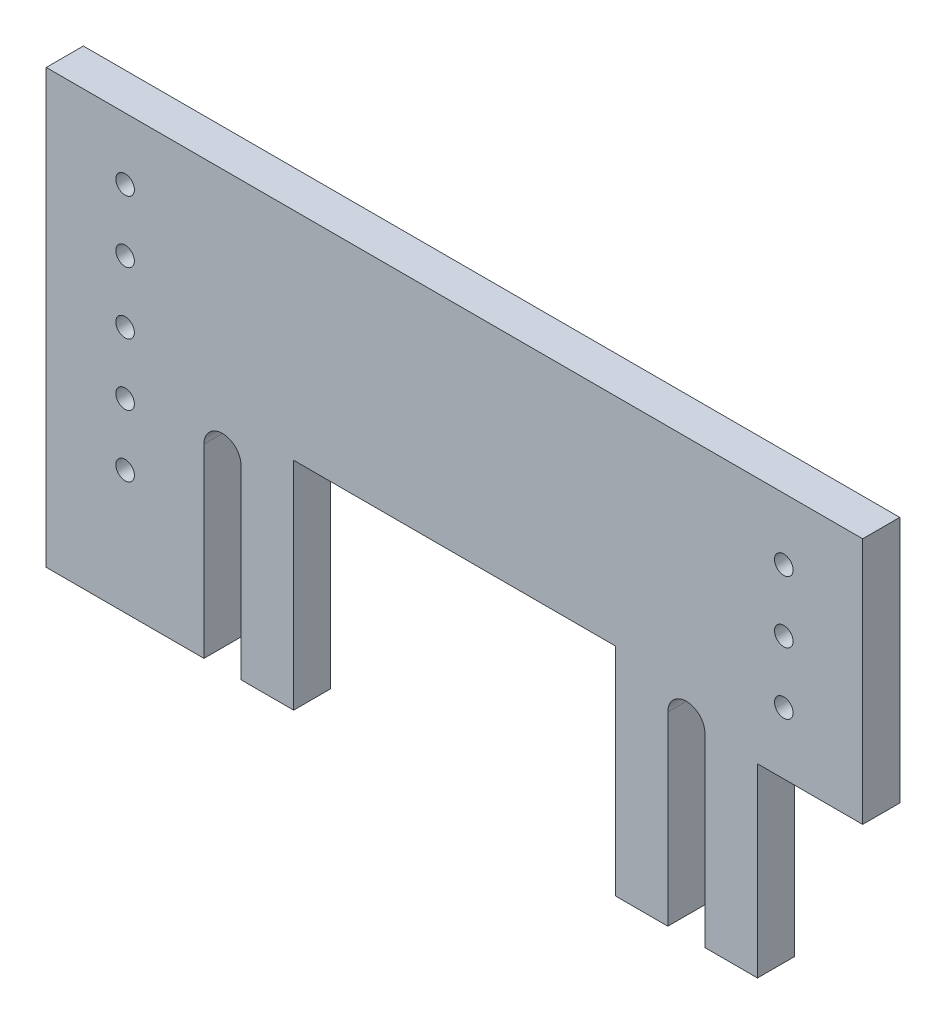
ISO-10303-21;
HEADER;
FILE_DESCRIPTION(('STEP AP214'),'2;1');
FILE_NAME('part.step','',(''),(''),'','','');
FILE_SCHEMA(('AUTOMOTIVE_DESIGN { 1 0 10303 214 1 1 1 1 }'));
ENDSEC;
DATA;
#1=APPLICATION_CONTEXT('core data for automotive mechanical design processes');
#2=APPLICATION_PROTOCOL_DEFINITION('international standard','automotive_design',2000,#1);
#3=PRODUCT_CONTEXT('',#1,'mechanical');
#4=PRODUCT('Part','Part','',(#3));
#5=PRODUCT_RELATED_PRODUCT_CATEGORY('part','',(#4));
#6=PRODUCT_DEFINITION_FORMATION('','',#4);
#7=PRODUCT_DEFINITION_CONTEXT('part definition',#1,'design');
#8=PRODUCT_DEFINITION('design','',#6,#7);
#9=PRODUCT_DEFINITION_SHAPE('','',#8);
#10=(LENGTH_UNIT() NAMED_UNIT(*) SI_UNIT(.MILLI.,.METRE.));
#11=(NAMED_UNIT(*) PLANE_ANGLE_UNIT() SI_UNIT($,.RADIAN.));
#12=(NAMED_UNIT(*) SI_UNIT($,.STERADIAN.) SOLID_ANGLE_UNIT());
#13=UNCERTAINTY_MEASURE_WITH_UNIT(LENGTH_MEASURE(1.E-05),#10,'distance_accuracy_value','');
#14=(GEOMETRIC_REPRESENTATION_CONTEXT(3) GLOBAL_UNCERTAINTY_ASSIGNED_CONTEXT((#13)) GLOBAL_UNIT_ASSIGNED_CONTEXT((#10,
#11,#12)) REPRESENTATION_CONTEXT('',''));
#15=CARTESIAN_POINT('',(0.,0.,0.));
#16=DIRECTION('',(0.,0.,1.));
#17=DIRECTION('',(1.,0.,0.));
#18=AXIS2_PLACEMENT_3D('',#15,#16,#17);
#19=CARTESIAN_POINT('',(37.5,-5.,6.));
#20=DIRECTION('',(0.,0.,1.));
#21=DIRECTION('',(1.,0.,0.));
#22=AXIS2_PLACEMENT_3D('',#19,#20,#21);
#23=PLANE('',#22);
#24=CARTESIAN_POINT('',(53.25,25.,6.));
#25=DIRECTION('',(0.,0.,1.));
#26=DIRECTION('',(-1.,0.,0.));
#27=AXIS2_PLACEMENT_3D('',#24,#25,#26);
#28=CIRCLE('',#27,1.50000000000002);
#29=CARTESIAN_POINT('',(51.75,25.,6.));
#30=VERTEX_POINT('',#29);
#31=EDGE_CURVE('E385',#30,#30,#28,.T.);
#32=ORIENTED_EDGE('',*,*,#31,.F.);
#33=EDGE_LOOP('',(#32));
#34=FACE_BOUND('',#33,.T.);
#35=CARTESIAN_POINT('',(53.25,5.,6.));
#36=DIRECTION('',(0.,0.,1.));
#37=DIRECTION('',(-1.,0.,0.));
#38=AXIS2_PLACEMENT_3D('',#35,#36,#37);
#39=CIRCLE('',#38,1.50000000000002);
#40=CARTESIAN_POINT('',(51.75,5.,6.));
#41=VERTEX_POINT('',#40);
#42=EDGE_CURVE('E397',#41,#41,#39,.T.);
#43=ORIENTED_EDGE('',*,*,#42,.F.);
#44=EDGE_LOOP('',(#43));
#45=FACE_BOUND('',#44,.T.);
#46=CARTESIAN_POINT('',(-53.25,25.,6.));
#47=DIRECTION('',(0.,0.,1.));
#48=DIRECTION('',(1.,0.,0.));
#49=AXIS2_PLACEMENT_3D('',#46,#47,#48);
#50=CIRCLE('',#49,1.5);
#51=CARTESIAN_POINT('',(-51.75,25.,6.));
#52=VERTEX_POINT('',#51);
#53=EDGE_CURVE('E409',#52,#52,#50,.T.);
#54=ORIENTED_EDGE('',*,*,#53,.F.);
#55=EDGE_LOOP('',(#54));
#56=FACE_BOUND('',#55,.T.);
#57=CARTESIAN_POINT('',(-53.25,15.,6.));
#58=DIRECTION('',(0.,0.,1.));
#59=DIRECTION('',(1.,0.,0.));
#60=AXIS2_PLACEMENT_3D('',#57,#58,#59);
#61=CIRCLE('',#60,1.5);
#62=CARTESIAN_POINT('',(-51.75,15.,6.));
#63=VERTEX_POINT('',#62);
#64=EDGE_CURVE('E194',#63,#63,#61,.T.);
#65=ORIENTED_EDGE('',*,*,#64,.F.);
#66=EDGE_LOOP('',(#65));
#67=FACE_BOUND('',#66,.T.);
#68=DIRECTION('',(0.,-1.,0.));
#69=VECTOR('',#68,1.);
#70=CARTESIAN_POINT('',(-66.,-35.,6.));
#71=LINE('',#70,#69);
#72=CARTESIAN_POINT('',(-66.,35.,6.));
#73=VERTEX_POINT('',#72);
#74=CARTESIAN_POINT('',(-66.,-35.,6.));
#75=VERTEX_POINT('',#74);
#76=EDGE_CURVE('E225',#73,#75,#71,.T.);
#77=ORIENTED_EDGE('',*,*,#76,.T.);
#78=DIRECTION('',(1.,0.,0.));
#79=VECTOR('',#78,1.);
#80=CARTESIAN_POINT('',(-66.,-35.,6.));
#81=LINE('',#80,#79);
#82=CARTESIAN_POINT('',(-40.5,-35.,6.));
#83=VERTEX_POINT('',#82);
#84=EDGE_CURVE('E123',#75,#83,#81,.T.);
#85=ORIENTED_EDGE('',*,*,#84,.T.);
#86=DIRECTION('',(0.,1.,0.));
#87=VECTOR('',#86,1.);
#88=CARTESIAN_POINT('',(-40.5,-5.,6.));
#89=LINE('',#88,#87);
#90=CARTESIAN_POINT('',(-40.5,-5.,6.));
#91=VERTEX_POINT('',#90);
#92=EDGE_CURVE('E270',#83,#91,#89,.T.);
#93=ORIENTED_EDGE('',*,*,#92,.T.);
#94=CARTESIAN_POINT('',(-37.5,-5.,6.));
#95=DIRECTION('',(0.,0.,-1.));
#96=DIRECTION('',(1.,0.,0.));
#97=AXIS2_PLACEMENT_3D('',#94,#95,#96);
#98=CIRCLE('',#97,3.);
#99=CARTESIAN_POINT('',(-34.5,-5.,6.));
#100=VERTEX_POINT('',#99);
#101=EDGE_CURVE('E289',#91,#100,#98,.T.);
#102=ORIENTED_EDGE('',*,*,#101,.T.);
#103=DIRECTION('',(0.,-1.,0.));
#104=VECTOR('',#103,1.);
#105=CARTESIAN_POINT('',(-34.5,-5.,6.));
#106=LINE('',#105,#104);
#107=CARTESIAN_POINT('',(-34.5,-35.,6.));
#108=VERTEX_POINT('',#107);
#109=EDGE_CURVE('E286',#100,#108,#106,.T.);
#110=ORIENTED_EDGE('',*,*,#109,.T.);
#111=DIRECTION('',(1.,0.,0.));
#112=VECTOR('',#111,1.);
#113=CARTESIAN_POINT('',(-26.,-35.,6.));
#114=LINE('',#113,#112);
#115=CARTESIAN_POINT('',(-26.,-35.,6.));
#116=VERTEX_POINT('',#115);
#117=EDGE_CURVE('E288',#108,#116,#114,.T.);
#118=ORIENTED_EDGE('',*,*,#117,.T.);
#119=DIRECTION('',(0.,1.,0.));
#120=VECTOR('',#119,1.);
#121=CARTESIAN_POINT('',(-26.,-35.,6.));
#122=LINE('',#121,#120);
#123=CARTESIAN_POINT('',(-26.,0.,6.));
#124=VERTEX_POINT('',#123);
#125=EDGE_CURVE('E291',#116,#124,#122,.T.);
#126=ORIENTED_EDGE('',*,*,#125,.T.);
#127=DIRECTION('',(1.,0.,0.));
#128=VECTOR('',#127,1.);
#129=CARTESIAN_POINT('',(26.,0.,6.));
#130=LINE('',#129,#128);
#131=CARTESIAN_POINT('',(26.,0.,6.));
#132=VERTEX_POINT('',#131);
#133=EDGE_CURVE('E297',#124,#132,#130,.T.);
#134=ORIENTED_EDGE('',*,*,#133,.T.);
#135=DIRECTION('',(0.,-1.,0.));
#136=VECTOR('',#135,1.);
#137=CARTESIAN_POINT('',(26.,-35.,6.));
#138=LINE('',#137,#136);
#139=CARTESIAN_POINT('',(26.,-35.,6.));
#140=VERTEX_POINT('',#139);
#141=EDGE_CURVE('E299',#132,#140,#138,.T.);
#142=ORIENTED_EDGE('',*,*,#141,.T.);
#143=DIRECTION('',(1.,0.,0.));
#144=VECTOR('',#143,1.);
#145=CARTESIAN_POINT('',(34.5,-35.,6.));
#146=LINE('',#145,#144);
#147=CARTESIAN_POINT('',(34.5,-35.,6.));
#148=VERTEX_POINT('',#147);
#149=EDGE_CURVE('E301',#140,#148,#146,.T.);
#150=ORIENTED_EDGE('',*,*,#149,.T.);
#151=DIRECTION('',(0.,1.,0.));
#152=VECTOR('',#151,1.);
#153=CARTESIAN_POINT('',(34.5,-5.,6.));
#154=LINE('',#153,#152);
#155=CARTESIAN_POINT('',(34.5,-5.,6.));
#156=VERTEX_POINT('',#155);
#157=EDGE_CURVE('E303',#148,#156,#154,.T.);
#158=ORIENTED_EDGE('',*,*,#157,.T.);
#159=CARTESIAN_POINT('',(37.5,-5.,6.));
#160=DIRECTION('',(0.,0.,-1.));
#161=DIRECTION('',(1.,0.,0.));
#162=AXIS2_PLACEMENT_3D('',#159,#160,#161);
#163=CIRCLE('',#162,3.);
#164=CARTESIAN_POINT('',(40.5,-5.,6.));
#165=VERTEX_POINT('',#164);
#166=EDGE_CURVE('E305',#156,#165,#163,.T.);
#167=ORIENTED_EDGE('',*,*,#166,.T.);
#168=DIRECTION('',(0.,-1.,0.));
#169=VECTOR('',#168,1.);
#170=CARTESIAN_POINT('',(40.5,-5.,6.));
#171=LINE('',#170,#169);
#172=CARTESIAN_POINT('',(40.5,-35.,6.));
#173=VERTEX_POINT('',#172);
#174=EDGE_CURVE('E307',#165,#173,#171,.T.);
#175=ORIENTED_EDGE('',*,*,#174,.T.);
#176=DIRECTION('',(1.,0.,0.));
#177=VECTOR('',#176,1.);
#178=CARTESIAN_POINT('',(40.5,-35.,6.));
#179=LINE('',#178,#177);
#180=CARTESIAN_POINT('',(49.,-35.,6.));
#181=VERTEX_POINT('',#180);
#182=EDGE_CURVE('E309',#173,#181,#179,.T.);
#183=ORIENTED_EDGE('',*,*,#182,.T.);
#184=DIRECTION('',(0.,1.,0.));
#185=VECTOR('',#184,1.);
#186=CARTESIAN_POINT('',(49.,-35.,6.));
#187=LINE('',#186,#185);
#188=CARTESIAN_POINT('',(49.,-5.,6.));
#189=VERTEX_POINT('',#188);
#190=EDGE_CURVE('E172',#181,#189,#187,.T.);
#191=ORIENTED_EDGE('',*,*,#190,.T.);
#192=DIRECTION('',(1.,0.,0.));
#193=VECTOR('',#192,1.);
#194=CARTESIAN_POINT('',(49.,-5.,6.));
#195=LINE('',#194,#193);
#196=CARTESIAN_POINT('',(66.,-5.,6.));
#197=VERTEX_POINT('',#196);
#198=EDGE_CURVE('E166',#189,#197,#195,.T.);
#199=ORIENTED_EDGE('',*,*,#198,.T.);
#200=DIRECTION('',(0.,1.,0.));
#201=VECTOR('',#200,1.);
#202=CARTESIAN_POINT('',(66.,-5.,6.));
#203=LINE('',#202,#201);
#204=CARTESIAN_POINT('',(66.,35.,6.));
#205=VERTEX_POINT('',#204);
#206=EDGE_CURVE('E170',#197,#205,#203,.T.);
#207=ORIENTED_EDGE('',*,*,#206,.T.);
#208=DIRECTION('',(-1.,0.,0.));
#209=VECTOR('',#208,1.);
#210=CARTESIAN_POINT('',(66.,35.,6.));
#211=LINE('',#210,#209);
#212=EDGE_CURVE('E50',#205,#73,#211,.T.);
#213=ORIENTED_EDGE('',*,*,#212,.T.);
#214=EDGE_LOOP('',(#77,#85,#93,#102,#110,#118,#126,#134,#142,#150,#158,#167,#175,#183,#191,#199,
#207,#213));
#215=FACE_BOUND('',#214,.T.);
#216=CARTESIAN_POINT('',(-53.25,-5.,6.));
#217=DIRECTION('',(0.,0.,1.));
#218=DIRECTION('',(1.,0.,0.));
#219=AXIS2_PLACEMENT_3D('',#216,#217,#218);
#220=CIRCLE('',#219,1.5);
#221=CARTESIAN_POINT('',(-51.75,-5.,6.));
#222=VERTEX_POINT('',#221);
#223=EDGE_CURVE('E415',#222,#222,#220,.T.);
#224=ORIENTED_EDGE('',*,*,#223,.F.);
#225=EDGE_LOOP('',(#224));
#226=FACE_BOUND('',#225,.T.);
#227=CARTESIAN_POINT('',(-53.25,-15.,6.));
#228=DIRECTION('',(0.,0.,1.));
#229=DIRECTION('',(1.,0.,0.));
#230=AXIS2_PLACEMENT_3D('',#227,#228,#229);
#231=CIRCLE('',#230,1.5);
#232=CARTESIAN_POINT('',(-51.75,-15.,6.));
#233=VERTEX_POINT('',#232);
#234=EDGE_CURVE('E403',#233,#233,#231,.T.);
#235=ORIENTED_EDGE('',*,*,#234,.F.);
#236=EDGE_LOOP('',(#235));
#237=FACE_BOUND('',#236,.T.);
#238=CARTESIAN_POINT('',(-53.25,5.,6.));
#239=DIRECTION('',(0.,0.,1.));
#240=DIRECTION('',(1.,0.,0.));
#241=AXIS2_PLACEMENT_3D('',#238,#239,#240);
#242=CIRCLE('',#241,1.5);
#243=CARTESIAN_POINT('',(-51.75,5.,6.));
#244=VERTEX_POINT('',#243);
#245=EDGE_CURVE('E391',#244,#244,#242,.T.);
#246=ORIENTED_EDGE('',*,*,#245,.F.);
#247=EDGE_LOOP('',(#246));
#248=FACE_BOUND('',#247,.T.);
#249=CARTESIAN_POINT('',(53.25,15.,6.));
#250=DIRECTION('',(0.,0.,1.));
#251=DIRECTION('',(-1.,0.,0.));
#252=AXIS2_PLACEMENT_3D('',#249,#250,#251);
#253=CIRCLE('',#252,1.49999999999999);
#254=CARTESIAN_POINT('',(51.75,15.,6.));
#255=VERTEX_POINT('',#254);
#256=EDGE_CURVE('E376',#255,#255,#253,.T.);
#257=ORIENTED_EDGE('',*,*,#256,.F.);
#258=EDGE_LOOP('',(#257));
#259=FACE_BOUND('',#258,.T.);
#260=ADVANCED_FACE('F33',(#34,#45,#56,#67,#215,#226,#237,#248,#259),#23,.T.);
#261=CARTESIAN_POINT('',(37.5,-5.,0.));
#262=DIRECTION('',(0.,0.,1.));
#263=DIRECTION('',(1.,0.,0.));
#264=AXIS2_PLACEMENT_3D('',#261,#262,#263);
#265=PLANE('',#264);
#266=DIRECTION('',(0.,-1.,0.));
#267=VECTOR('',#266,1.);
#268=CARTESIAN_POINT('',(-66.,-35.,0.));
#269=LINE('',#268,#267);
#270=CARTESIAN_POINT('',(-66.,35.,0.));
#271=VERTEX_POINT('',#270);
#272=CARTESIAN_POINT('',(-66.,-35.,0.));
#273=VERTEX_POINT('',#272);
#274=EDGE_CURVE('E190',#271,#273,#269,.T.);
#275=ORIENTED_EDGE('',*,*,#274,.F.);
#276=DIRECTION('',(-1.,0.,0.));
#277=VECTOR('',#276,1.);
#278=CARTESIAN_POINT('',(66.,35.,0.));
#279=LINE('',#278,#277);
#280=CARTESIAN_POINT('',(66.,35.,0.));
#281=VERTEX_POINT('',#280);
#282=EDGE_CURVE('E115',#281,#271,#279,.T.);
#283=ORIENTED_EDGE('',*,*,#282,.F.);
#284=DIRECTION('',(0.,1.,0.));
#285=VECTOR('',#284,1.);
#286=CARTESIAN_POINT('',(66.,-5.,0.));
#287=LINE('',#286,#285);
#288=CARTESIAN_POINT('',(66.,-5.,0.));
#289=VERTEX_POINT('',#288);
#290=EDGE_CURVE('E109',#289,#281,#287,.T.);
#291=ORIENTED_EDGE('',*,*,#290,.F.);
#292=DIRECTION('',(1.,0.,0.));
#293=VECTOR('',#292,1.);
#294=CARTESIAN_POINT('',(49.,-5.,0.));
#295=LINE('',#294,#293);
#296=CARTESIAN_POINT('',(49.,-5.,0.));
#297=VERTEX_POINT('',#296);
#298=EDGE_CURVE('E180',#297,#289,#295,.T.);
#299=ORIENTED_EDGE('',*,*,#298,.F.);
#300=DIRECTION('',(0.,1.,0.));
#301=VECTOR('',#300,1.);
#302=CARTESIAN_POINT('',(49.,-35.,0.));
#303=LINE('',#302,#301);
#304=CARTESIAN_POINT('',(49.,-35.,0.));
#305=VERTEX_POINT('',#304);
#306=EDGE_CURVE('E220',#305,#297,#303,.T.);
#307=ORIENTED_EDGE('',*,*,#306,.F.);
#308=DIRECTION('',(1.,0.,0.));
#309=VECTOR('',#308,1.);
#310=CARTESIAN_POINT('',(40.5,-35.,0.));
#311=LINE('',#310,#309);
#312=CARTESIAN_POINT('',(40.5,-35.,0.));
#313=VERTEX_POINT('',#312);
#314=EDGE_CURVE('E218',#313,#305,#311,.T.);
#315=ORIENTED_EDGE('',*,*,#314,.F.);
#316=DIRECTION('',(0.,-1.,0.));
#317=VECTOR('',#316,1.);
#318=CARTESIAN_POINT('',(40.5,-5.,0.));
#319=LINE('',#318,#317);
#320=CARTESIAN_POINT('',(40.5,-5.,0.));
#321=VERTEX_POINT('',#320);
#322=EDGE_CURVE('E216',#321,#313,#319,.T.);
#323=ORIENTED_EDGE('',*,*,#322,.F.);
#324=CARTESIAN_POINT('',(37.5,-5.,0.));
#325=DIRECTION('',(0.,0.,-1.));
#326=DIRECTION('',(1.,0.,0.));
#327=AXIS2_PLACEMENT_3D('',#324,#325,#326);
#328=CIRCLE('',#327,3.);
#329=CARTESIAN_POINT('',(34.5,-5.,0.));
#330=VERTEX_POINT('',#329);
#331=EDGE_CURVE('E214',#330,#321,#328,.T.);
#332=ORIENTED_EDGE('',*,*,#331,.F.);
#333=DIRECTION('',(0.,1.,0.));
#334=VECTOR('',#333,1.);
#335=CARTESIAN_POINT('',(34.5,-5.,0.));
#336=LINE('',#335,#334);
#337=CARTESIAN_POINT('',(34.5,-35.,0.));
#338=VERTEX_POINT('',#337);
#339=EDGE_CURVE('E212',#338,#330,#336,.T.);
#340=ORIENTED_EDGE('',*,*,#339,.F.);
#341=DIRECTION('',(1.,0.,0.));
#342=VECTOR('',#341,1.);
#343=CARTESIAN_POINT('',(34.5,-35.,0.));
#344=LINE('',#343,#342);
#345=CARTESIAN_POINT('',(26.,-35.,0.));
#346=VERTEX_POINT('',#345);
#347=EDGE_CURVE('E210',#346,#338,#344,.T.);
#348=ORIENTED_EDGE('',*,*,#347,.F.);
#349=DIRECTION('',(0.,-1.,0.));
#350=VECTOR('',#349,1.);
#351=CARTESIAN_POINT('',(26.,-35.,0.));
#352=LINE('',#351,#350);
#353=CARTESIAN_POINT('',(26.,0.,0.));
#354=VERTEX_POINT('',#353);
#355=EDGE_CURVE('E208',#354,#346,#352,.T.);
#356=ORIENTED_EDGE('',*,*,#355,.F.);
#357=DIRECTION('',(1.,0.,0.));
#358=VECTOR('',#357,1.);
#359=CARTESIAN_POINT('',(26.,0.,0.));
#360=LINE('',#359,#358);
#361=CARTESIAN_POINT('',(-26.,0.,0.));
#362=VERTEX_POINT('',#361);
#363=EDGE_CURVE('E206',#362,#354,#360,.T.);
#364=ORIENTED_EDGE('',*,*,#363,.F.);
#365=DIRECTION('',(0.,1.,0.));
#366=VECTOR('',#365,1.);
#367=CARTESIAN_POINT('',(-26.,-35.,0.));
#368=LINE('',#367,#366);
#369=CARTESIAN_POINT('',(-26.,-35.,0.));
#370=VERTEX_POINT('',#369);
#371=EDGE_CURVE('E204',#370,#362,#368,.T.);
#372=ORIENTED_EDGE('',*,*,#371,.F.);
#373=DIRECTION('',(1.,0.,0.));
#374=VECTOR('',#373,1.);
#375=CARTESIAN_POINT('',(-26.,-35.,0.));
#376=LINE('',#375,#374);
#377=CARTESIAN_POINT('',(-34.5,-35.,0.));
#378=VERTEX_POINT('',#377);
#379=EDGE_CURVE('E202',#378,#370,#376,.T.);
#380=ORIENTED_EDGE('',*,*,#379,.F.);
#381=DIRECTION('',(0.,-1.,0.));
#382=VECTOR('',#381,1.);
#383=CARTESIAN_POINT('',(-34.5,-5.,0.));
#384=LINE('',#383,#382);
#385=CARTESIAN_POINT('',(-34.5,-5.,0.));
#386=VERTEX_POINT('',#385);
#387=EDGE_CURVE('E200',#386,#378,#384,.T.);
#388=ORIENTED_EDGE('',*,*,#387,.F.);
#389=CARTESIAN_POINT('',(-37.5,-5.,0.));
#390=DIRECTION('',(0.,0.,-1.));
#391=DIRECTION('',(1.,0.,0.));
#392=AXIS2_PLACEMENT_3D('',#389,#390,#391);
#393=CIRCLE('',#392,3.);
#394=CARTESIAN_POINT('',(-40.5,-5.,0.));
#395=VERTEX_POINT('',#394);
#396=EDGE_CURVE('E198',#395,#386,#393,.T.);
#397=ORIENTED_EDGE('',*,*,#396,.F.);
#398=DIRECTION('',(0.,1.,0.));
#399=VECTOR('',#398,1.);
#400=CARTESIAN_POINT('',(-40.5,-5.,0.));
#401=LINE('',#400,#399);
#402=CARTESIAN_POINT('',(-40.5,-35.,0.));
#403=VERTEX_POINT('',#402);
#404=EDGE_CURVE('E196',#403,#395,#401,.T.);
#405=ORIENTED_EDGE('',*,*,#404,.F.);
#406=DIRECTION('',(1.,0.,0.));
#407=VECTOR('',#406,1.);
#408=CARTESIAN_POINT('',(-66.,-35.,0.));
#409=LINE('',#408,#407);
#410=EDGE_CURVE('E193',#273,#403,#409,.T.);
#411=ORIENTED_EDGE('',*,*,#410,.F.);
#412=EDGE_LOOP('',(#275,#283,#291,#299,#307,#315,#323,#332,#340,#348,#356,#364,#372,#380,#388,
#397,#405,#411));
#413=FACE_BOUND('',#412,.T.);
#414=CARTESIAN_POINT('',(-53.25,15.,0.));
#415=DIRECTION('',(0.,0.,1.));
#416=DIRECTION('',(1.,0.,0.));
#417=AXIS2_PLACEMENT_3D('',#414,#415,#416);
#418=CIRCLE('',#417,1.5);
#419=CARTESIAN_POINT('',(-51.75,15.,0.));
#420=VERTEX_POINT('',#419);
#421=EDGE_CURVE('E418',#420,#420,#418,.T.);
#422=ORIENTED_EDGE('',*,*,#421,.T.);
#423=EDGE_LOOP('',(#422));
#424=FACE_BOUND('',#423,.T.);
#425=CARTESIAN_POINT('',(-53.25,-5.,0.));
#426=DIRECTION('',(0.,0.,1.));
#427=DIRECTION('',(1.,0.,0.));
#428=AXIS2_PLACEMENT_3D('',#425,#426,#427);
#429=CIRCLE('',#428,1.5);
#430=CARTESIAN_POINT('',(-51.75,-5.,0.));
#431=VERTEX_POINT('',#430);
#432=EDGE_CURVE('E412',#431,#431,#429,.T.);
#433=ORIENTED_EDGE('',*,*,#432,.T.);
#434=EDGE_LOOP('',(#433));
#435=FACE_BOUND('',#434,.T.);
#436=CARTESIAN_POINT('',(-53.25,25.,0.));
#437=DIRECTION('',(0.,0.,1.));
#438=DIRECTION('',(1.,0.,0.));
#439=AXIS2_PLACEMENT_3D('',#436,#437,#438);
#440=CIRCLE('',#439,1.5);
#441=CARTESIAN_POINT('',(-51.75,25.,0.));
#442=VERTEX_POINT('',#441);
#443=EDGE_CURVE('E406',#442,#442,#440,.T.);
#444=ORIENTED_EDGE('',*,*,#443,.T.);
#445=EDGE_LOOP('',(#444));
#446=FACE_BOUND('',#445,.T.);
#447=CARTESIAN_POINT('',(-53.25,-15.,0.));
#448=DIRECTION('',(0.,0.,1.));
#449=DIRECTION('',(1.,0.,0.));
#450=AXIS2_PLACEMENT_3D('',#447,#448,#449);
#451=CIRCLE('',#450,1.5);
#452=CARTESIAN_POINT('',(-51.75,-15.,0.));
#453=VERTEX_POINT('',#452);
#454=EDGE_CURVE('E400',#453,#453,#451,.T.);
#455=ORIENTED_EDGE('',*,*,#454,.T.);
#456=EDGE_LOOP('',(#455));
#457=FACE_BOUND('',#456,.T.);
#458=CARTESIAN_POINT('',(53.25,5.,0.));
#459=DIRECTION('',(0.,0.,1.));
#460=DIRECTION('',(-1.,0.,0.));
#461=AXIS2_PLACEMENT_3D('',#458,#459,#460);
#462=CIRCLE('',#461,1.50000000000002);
#463=CARTESIAN_POINT('',(51.75,5.,0.));
#464=VERTEX_POINT('',#463);
#465=EDGE_CURVE('E394',#464,#464,#462,.T.);
#466=ORIENTED_EDGE('',*,*,#465,.T.);
#467=EDGE_LOOP('',(#466));
#468=FACE_BOUND('',#467,.T.);
#469=CARTESIAN_POINT('',(-53.25,5.,0.));
#470=DIRECTION('',(0.,0.,1.));
#471=DIRECTION('',(1.,0.,0.));
#472=AXIS2_PLACEMENT_3D('',#469,#470,#471);
#473=CIRCLE('',#472,1.5);
#474=CARTESIAN_POINT('',(-51.75,5.,0.));
#475=VERTEX_POINT('',#474);
#476=EDGE_CURVE('E388',#475,#475,#473,.T.);
#477=ORIENTED_EDGE('',*,*,#476,.T.);
#478=EDGE_LOOP('',(#477));
#479=FACE_BOUND('',#478,.T.);
#480=CARTESIAN_POINT('',(53.25,25.,0.));
#481=DIRECTION('',(0.,0.,1.));
#482=DIRECTION('',(-1.,0.,0.));
#483=AXIS2_PLACEMENT_3D('',#480,#481,#482);
#484=CIRCLE('',#483,1.50000000000002);
#485=CARTESIAN_POINT('',(51.75,25.,0.));
#486=VERTEX_POINT('',#485);
#487=EDGE_CURVE('E382',#486,#486,#484,.T.);
#488=ORIENTED_EDGE('',*,*,#487,.T.);
#489=EDGE_LOOP('',(#488));
#490=FACE_BOUND('',#489,.T.);
#491=CARTESIAN_POINT('',(53.25,15.,0.));
#492=DIRECTION('',(0.,0.,1.));
#493=DIRECTION('',(-1.,0.,0.));
#494=AXIS2_PLACEMENT_3D('',#491,#492,#493);
#495=CIRCLE('',#494,1.49999999999999);
#496=CARTESIAN_POINT('',(51.75,15.,0.));
#497=VERTEX_POINT('',#496);
#498=EDGE_CURVE('E379',#497,#497,#495,.T.);
#499=ORIENTED_EDGE('',*,*,#498,.T.);
#500=EDGE_LOOP('',(#499));
#501=FACE_BOUND('',#500,.T.);
#502=ADVANCED_FACE('F274',(#413,#424,#435,#446,#457,#468,#479,#490,#501),#265,.F.);
#503=CARTESIAN_POINT('',(-66.,-35.,6.));
#504=DIRECTION('',(1.,0.,0.));
#505=DIRECTION('',(0.,0.,-1.));
#506=AXIS2_PLACEMENT_3D('',#503,#504,#505);
#507=PLANE('',#506);
#508=ORIENTED_EDGE('',*,*,#274,.T.);
#509=DIRECTION('',(0.,0.,-1.));
#510=VECTOR('',#509,1.);
#511=CARTESIAN_POINT('',(-66.,-35.,6.));
#512=LINE('',#511,#510);
#513=EDGE_CURVE('E11',#75,#273,#512,.T.);
#514=ORIENTED_EDGE('',*,*,#513,.F.);
#515=ORIENTED_EDGE('',*,*,#76,.F.);
#516=DIRECTION('',(0.,0.,-1.));
#517=VECTOR('',#516,1.);
#518=CARTESIAN_POINT('',(-66.,35.,6.));
#519=LINE('',#518,#517);
#520=EDGE_CURVE('E186',#73,#271,#519,.T.);
#521=ORIENTED_EDGE('',*,*,#520,.T.);
#522=EDGE_LOOP('',(#508,#514,#515,#521));
#523=FACE_BOUND('',#522,.T.);
#524=ADVANCED_FACE('F35',(#523),#507,.F.);
#525=CARTESIAN_POINT('',(-66.,-35.,6.));
#526=DIRECTION('',(0.,1.,0.));
#527=DIRECTION('',(0.,0.,1.));
#528=AXIS2_PLACEMENT_3D('',#525,#526,#527);
#529=PLANE('',#528);
#530=ORIENTED_EDGE('',*,*,#410,.T.);
#531=DIRECTION('',(0.,0.,-1.));
#532=VECTOR('',#531,1.);
#533=CARTESIAN_POINT('',(-40.5,-35.,6.));
#534=LINE('',#533,#532);
#535=EDGE_CURVE('E42',#83,#403,#534,.T.);
#536=ORIENTED_EDGE('',*,*,#535,.F.);
#537=ORIENTED_EDGE('',*,*,#84,.F.);
#538=ORIENTED_EDGE('',*,*,#513,.T.);
#539=EDGE_LOOP('',(#530,#536,#537,#538));
#540=FACE_BOUND('',#539,.T.);
#541=ADVANCED_FACE('F624',(#540),#529,.F.);
#542=CARTESIAN_POINT('',(-40.5,-5.,6.));
#543=DIRECTION('',(-1.,0.,0.));
#544=DIRECTION('',(0.,-1.,0.));
#545=AXIS2_PLACEMENT_3D('',#542,#543,#544);
#546=PLANE('',#545);
#547=ORIENTED_EDGE('',*,*,#404,.T.);
#548=DIRECTION('',(0.,0.,-1.));
#549=VECTOR('',#548,1.);
#550=CARTESIAN_POINT('',(-40.5,-5.,6.));
#551=LINE('',#550,#549);
#552=EDGE_CURVE('E262',#91,#395,#551,.T.);
#553=ORIENTED_EDGE('',*,*,#552,.F.);
#554=ORIENTED_EDGE('',*,*,#92,.F.);
#555=ORIENTED_EDGE('',*,*,#535,.T.);
#556=EDGE_LOOP('',(#547,#553,#554,#555));
#557=FACE_BOUND('',#556,.T.);
#558=ADVANCED_FACE('F268',(#557),#546,.F.);
#559=CARTESIAN_POINT('',(-37.5,-5.,6.));
#560=DIRECTION('',(0.,0.,-1.));
#561=DIRECTION('',(-1.,0.,0.));
#562=AXIS2_PLACEMENT_3D('',#559,#560,#561);
#563=CYLINDRICAL_SURFACE('',#562,3.);
#564=ORIENTED_EDGE('',*,*,#396,.T.);
#565=DIRECTION('',(0.,0.,-1.));
#566=VECTOR('',#565,1.);
#567=CARTESIAN_POINT('',(-34.5,-5.,6.));
#568=LINE('',#567,#566);
#569=EDGE_CURVE('E259',#100,#386,#568,.T.);
#570=ORIENTED_EDGE('',*,*,#569,.F.);
#571=ORIENTED_EDGE('',*,*,#101,.F.);
#572=ORIENTED_EDGE('',*,*,#552,.T.);
#573=EDGE_LOOP('',(#564,#570,#571,#572));
#574=FACE_BOUND('',#573,.T.);
#575=ADVANCED_FACE('F280',(#574),#563,.F.);
#576=CARTESIAN_POINT('',(-34.5,-5.,6.));
#577=DIRECTION('',(1.,0.,0.));
#578=DIRECTION('',(0.,0.,-1.));
#579=AXIS2_PLACEMENT_3D('',#576,#577,#578);
#580=PLANE('',#579);
#581=ORIENTED_EDGE('',*,*,#387,.T.);
#582=DIRECTION('',(0.,0.,-1.));
#583=VECTOR('',#582,1.);
#584=CARTESIAN_POINT('',(-34.5,-35.,6.));
#585=LINE('',#584,#583);
#586=EDGE_CURVE('E256',#108,#378,#585,.T.);
#587=ORIENTED_EDGE('',*,*,#586,.F.);
#588=ORIENTED_EDGE('',*,*,#109,.F.);
#589=ORIENTED_EDGE('',*,*,#569,.T.);
#590=EDGE_LOOP('',(#581,#587,#588,#589));
#591=FACE_BOUND('',#590,.T.);
#592=ADVANCED_FACE('F284',(#591),#580,.F.);
#593=CARTESIAN_POINT('',(-26.,-35.,6.));
#594=DIRECTION('',(0.,1.,0.));
#595=DIRECTION('',(0.,0.,1.));
#596=AXIS2_PLACEMENT_3D('',#593,#594,#595);
#597=PLANE('',#596);
#598=ORIENTED_EDGE('',*,*,#379,.T.);
#599=DIRECTION('',(0.,0.,-1.));
#600=VECTOR('',#599,1.);
#601=CARTESIAN_POINT('',(-26.,-35.,6.));
#602=LINE('',#601,#600);
#603=EDGE_CURVE('E253',#116,#370,#602,.T.);
#604=ORIENTED_EDGE('',*,*,#603,.F.);
#605=ORIENTED_EDGE('',*,*,#117,.F.);
#606=ORIENTED_EDGE('',*,*,#586,.T.);
#607=EDGE_LOOP('',(#598,#604,#605,#606));
#608=FACE_BOUND('',#607,.T.);
#609=ADVANCED_FACE('F589',(#608),#597,.F.);
#610=CARTESIAN_POINT('',(-26.,-35.,6.));
#611=DIRECTION('',(-1.,0.,0.));
#612=DIRECTION('',(0.,0.,1.));
#613=AXIS2_PLACEMENT_3D('',#610,#611,#612);
#614=PLANE('',#613);
#615=ORIENTED_EDGE('',*,*,#371,.T.);
#616=DIRECTION('',(0.,0.,-1.));
#617=VECTOR('',#616,1.);
#618=CARTESIAN_POINT('',(-26.,0.,6.));
#619=LINE('',#618,#617);
#620=EDGE_CURVE('E250',#124,#362,#619,.T.);
#621=ORIENTED_EDGE('',*,*,#620,.F.);
#622=ORIENTED_EDGE('',*,*,#125,.F.);
#623=ORIENTED_EDGE('',*,*,#603,.T.);
#624=EDGE_LOOP('',(#615,#621,#622,#623));
#625=FACE_BOUND('',#624,.T.);
#626=ADVANCED_FACE('F579',(#625),#614,.F.);
#627=CARTESIAN_POINT('',(26.,0.,6.));
#628=DIRECTION('',(0.,1.,0.));
#629=DIRECTION('',(-1.,0.,0.));
#630=AXIS2_PLACEMENT_3D('',#627,#628,#629);
#631=PLANE('',#630);
#632=ORIENTED_EDGE('',*,*,#363,.T.);
#633=DIRECTION('',(0.,0.,-1.));
#634=VECTOR('',#633,1.);
#635=CARTESIAN_POINT('',(26.,0.,6.));
#636=LINE('',#635,#634);
#637=EDGE_CURVE('E247',#132,#354,#636,.T.);
#638=ORIENTED_EDGE('',*,*,#637,.F.);
#639=ORIENTED_EDGE('',*,*,#133,.F.);
#640=ORIENTED_EDGE('',*,*,#620,.T.);
#641=EDGE_LOOP('',(#632,#638,#639,#640));
#642=FACE_BOUND('',#641,.T.);
#643=ADVANCED_FACE('F569',(#642),#631,.F.);
#644=CARTESIAN_POINT('',(26.,-35.,6.));
#645=DIRECTION('',(1.,0.,0.));
#646=DIRECTION('',(0.,0.,-1.));
#647=AXIS2_PLACEMENT_3D('',#644,#645,#646);
#648=PLANE('',#647);
#649=ORIENTED_EDGE('',*,*,#355,.T.);
#650=DIRECTION('',(0.,0.,-1.));
#651=VECTOR('',#650,1.);
#652=CARTESIAN_POINT('',(26.,-35.,6.));
#653=LINE('',#652,#651);
#654=EDGE_CURVE('E244',#140,#346,#653,.T.);
#655=ORIENTED_EDGE('',*,*,#654,.F.);
#656=ORIENTED_EDGE('',*,*,#141,.F.);
#657=ORIENTED_EDGE('',*,*,#637,.T.);
#658=EDGE_LOOP('',(#649,#655,#656,#657));
#659=FACE_BOUND('',#658,.T.);
#660=ADVANCED_FACE('F559',(#659),#648,.F.);
#661=CARTESIAN_POINT('',(34.5,-35.,6.));
#662=DIRECTION('',(0.,1.,0.));
#663=DIRECTION('',(0.,0.,1.));
#664=AXIS2_PLACEMENT_3D('',#661,#662,#663);
#665=PLANE('',#664);
#666=ORIENTED_EDGE('',*,*,#347,.T.);
#667=DIRECTION('',(0.,0.,-1.));
#668=VECTOR('',#667,1.);
#669=CARTESIAN_POINT('',(34.5,-35.,6.));
#670=LINE('',#669,#668);
#671=EDGE_CURVE('E241',#148,#338,#670,.T.);
#672=ORIENTED_EDGE('',*,*,#671,.F.);
#673=ORIENTED_EDGE('',*,*,#149,.F.);
#674=ORIENTED_EDGE('',*,*,#654,.T.);
#675=EDGE_LOOP('',(#666,#672,#673,#674));
#676=FACE_BOUND('',#675,.T.);
#677=ADVANCED_FACE('F549',(#676),#665,.F.);
#678=CARTESIAN_POINT('',(34.5,-5.,6.));
#679=DIRECTION('',(-1.,0.,0.));
#680=DIRECTION('',(0.,-1.,0.));
#681=AXIS2_PLACEMENT_3D('',#678,#679,#680);
#682=PLANE('',#681);
#683=ORIENTED_EDGE('',*,*,#339,.T.);
#684=DIRECTION('',(0.,0.,-1.));
#685=VECTOR('',#684,1.);
#686=CARTESIAN_POINT('',(34.5,-5.,6.));
#687=LINE('',#686,#685);
#688=EDGE_CURVE('E238',#156,#330,#687,.T.);
#689=ORIENTED_EDGE('',*,*,#688,.F.);
#690=ORIENTED_EDGE('',*,*,#157,.F.);
#691=ORIENTED_EDGE('',*,*,#671,.T.);
#692=EDGE_LOOP('',(#683,#689,#690,#691));
#693=FACE_BOUND('',#692,.T.);
#694=ADVANCED_FACE('F539',(#693),#682,.F.);
#695=CARTESIAN_POINT('',(37.5,-5.,6.));
#696=DIRECTION('',(0.,0.,-1.));
#697=DIRECTION('',(-1.,0.,0.));
#698=AXIS2_PLACEMENT_3D('',#695,#696,#697);
#699=CYLINDRICAL_SURFACE('',#698,3.);
#700=ORIENTED_EDGE('',*,*,#331,.T.);
#701=DIRECTION('',(0.,0.,-1.));
#702=VECTOR('',#701,1.);
#703=CARTESIAN_POINT('',(40.5,-5.,6.));
#704=LINE('',#703,#702);
#705=EDGE_CURVE('E235',#165,#321,#704,.T.);
#706=ORIENTED_EDGE('',*,*,#705,.F.);
#707=ORIENTED_EDGE('',*,*,#166,.F.);
#708=ORIENTED_EDGE('',*,*,#688,.T.);
#709=EDGE_LOOP('',(#700,#706,#707,#708));
#710=FACE_BOUND('',#709,.T.);
#711=ADVANCED_FACE('F529',(#710),#699,.F.);
#712=CARTESIAN_POINT('',(40.5,-5.,6.));
#713=DIRECTION('',(1.,0.,0.));
#714=DIRECTION('',(0.,1.,0.));
#715=AXIS2_PLACEMENT_3D('',#712,#713,#714);
#716=PLANE('',#715);
#717=ORIENTED_EDGE('',*,*,#322,.T.);
#718=DIRECTION('',(0.,0.,-1.));
#719=VECTOR('',#718,1.);
#720=CARTESIAN_POINT('',(40.5,-35.,6.));
#721=LINE('',#720,#719);
#722=EDGE_CURVE('E232',#173,#313,#721,.T.);
#723=ORIENTED_EDGE('',*,*,#722,.F.);
#724=ORIENTED_EDGE('',*,*,#174,.F.);
#725=ORIENTED_EDGE('',*,*,#705,.T.);
#726=EDGE_LOOP('',(#717,#723,#724,#725));
#727=FACE_BOUND('',#726,.T.);
#728=ADVANCED_FACE('F520',(#727),#716,.F.);
#729=CARTESIAN_POINT('',(40.5,-35.,6.));
#730=DIRECTION('',(0.,1.,0.));
#731=DIRECTION('',(0.,0.,1.));
#732=AXIS2_PLACEMENT_3D('',#729,#730,#731);
#733=PLANE('',#732);
#734=ORIENTED_EDGE('',*,*,#314,.T.);
#735=DIRECTION('',(0.,0.,-1.));
#736=VECTOR('',#735,1.);
#737=CARTESIAN_POINT('',(49.,-35.,6.));
#738=LINE('',#737,#736);
#739=EDGE_CURVE('E229',#181,#305,#738,.T.);
#740=ORIENTED_EDGE('',*,*,#739,.F.);
#741=ORIENTED_EDGE('',*,*,#182,.F.);
#742=ORIENTED_EDGE('',*,*,#722,.T.);
#743=EDGE_LOOP('',(#734,#740,#741,#742));
#744=FACE_BOUND('',#743,.T.);
#745=ADVANCED_FACE('F315',(#744),#733,.F.);
#746=CARTESIAN_POINT('',(49.,-35.,6.));
#747=DIRECTION('',(-1.,0.,0.));
#748=DIRECTION('',(0.,0.,1.));
#749=AXIS2_PLACEMENT_3D('',#746,#747,#748);
#750=PLANE('',#749);
#751=ORIENTED_EDGE('',*,*,#306,.T.);
#752=DIRECTION('',(0.,0.,-1.));
#753=VECTOR('',#752,1.);
#754=CARTESIAN_POINT('',(49.,-5.,6.));
#755=LINE('',#754,#753);
#756=EDGE_CURVE('E181',#189,#297,#755,.T.);
#757=ORIENTED_EDGE('',*,*,#756,.F.);
#758=ORIENTED_EDGE('',*,*,#190,.F.);
#759=ORIENTED_EDGE('',*,*,#739,.T.);
#760=EDGE_LOOP('',(#751,#757,#758,#759));
#761=FACE_BOUND('',#760,.T.);
#762=ADVANCED_FACE('F319',(#761),#750,.F.);
#763=CARTESIAN_POINT('',(49.,-5.,6.));
#764=DIRECTION('',(0.,1.,0.));
#765=DIRECTION('',(-1.,0.,0.));
#766=AXIS2_PLACEMENT_3D('',#763,#764,#765);
#767=PLANE('',#766);
#768=ORIENTED_EDGE('',*,*,#298,.T.);
#769=DIRECTION('',(0.,0.,-1.));
#770=VECTOR('',#769,1.);
#771=CARTESIAN_POINT('',(66.,-5.,6.));
#772=LINE('',#771,#770);
#773=EDGE_CURVE('E177',#197,#289,#772,.T.);
#774=ORIENTED_EDGE('',*,*,#773,.F.);
#775=ORIENTED_EDGE('',*,*,#198,.F.);
#776=ORIENTED_EDGE('',*,*,#756,.T.);
#777=EDGE_LOOP('',(#768,#774,#775,#776));
#778=FACE_BOUND('',#777,.T.);
#779=ADVANCED_FACE('F178',(#778),#767,.F.);
#780=CARTESIAN_POINT('',(66.,-5.,6.));
#781=DIRECTION('',(-1.,0.,0.));
#782=DIRECTION('',(0.,0.,1.));
#783=AXIS2_PLACEMENT_3D('',#780,#781,#782);
#784=PLANE('',#783);
#785=ORIENTED_EDGE('',*,*,#290,.T.);
#786=DIRECTION('',(0.,0.,-1.));
#787=VECTOR('',#786,1.);
#788=CARTESIAN_POINT('',(66.,35.,6.));
#789=LINE('',#788,#787);
#790=EDGE_CURVE('E182',#205,#281,#789,.T.);
#791=ORIENTED_EDGE('',*,*,#790,.F.);
#792=ORIENTED_EDGE('',*,*,#206,.F.);
#793=ORIENTED_EDGE('',*,*,#773,.T.);
#794=EDGE_LOOP('',(#785,#791,#792,#793));
#795=FACE_BOUND('',#794,.T.);
#796=ADVANCED_FACE('F184',(#795),#784,.F.);
#797=CARTESIAN_POINT('',(66.,35.,6.));
#798=DIRECTION('',(0.,-1.,0.));
#799=DIRECTION('',(1.,0.,0.));
#800=AXIS2_PLACEMENT_3D('',#797,#798,#799);
#801=PLANE('',#800);
#802=ORIENTED_EDGE('',*,*,#282,.T.);
#803=ORIENTED_EDGE('',*,*,#520,.F.);
#804=ORIENTED_EDGE('',*,*,#212,.F.);
#805=ORIENTED_EDGE('',*,*,#790,.T.);
#806=EDGE_LOOP('',(#802,#803,#804,#805));
#807=FACE_BOUND('',#806,.T.);
#808=ADVANCED_FACE('F323',(#807),#801,.F.);
#809=CARTESIAN_POINT('',(-53.25,15.,6.));
#810=DIRECTION('',(0.,0.,-1.));
#811=DIRECTION('',(-1.,0.,0.));
#812=AXIS2_PLACEMENT_3D('',#809,#810,#811);
#813=CYLINDRICAL_SURFACE('',#812,1.5);
#814=ORIENTED_EDGE('',*,*,#64,.T.);
#815=EDGE_LOOP('',(#814));
#816=FACE_BOUND('',#815,.T.);
#817=ORIENTED_EDGE('',*,*,#421,.F.);
#818=EDGE_LOOP('',(#817));
#819=FACE_BOUND('',#818,.T.);
#820=ADVANCED_FACE('F325',(#816,#819),#813,.F.);
#821=CARTESIAN_POINT('',(-53.25,-5.,6.));
#822=DIRECTION('',(0.,0.,-1.));
#823=DIRECTION('',(-1.,0.,0.));
#824=AXIS2_PLACEMENT_3D('',#821,#822,#823);
#825=CYLINDRICAL_SURFACE('',#824,1.5);
#826=ORIENTED_EDGE('',*,*,#223,.T.);
#827=EDGE_LOOP('',(#826));
#828=FACE_BOUND('',#827,.T.);
#829=ORIENTED_EDGE('',*,*,#432,.F.);
#830=EDGE_LOOP('',(#829));
#831=FACE_BOUND('',#830,.T.);
#832=ADVANCED_FACE('F331',(#828,#831),#825,.F.);
#833=CARTESIAN_POINT('',(-53.25,25.,6.));
#834=DIRECTION('',(0.,0.,-1.));
#835=DIRECTION('',(-1.,0.,0.));
#836=AXIS2_PLACEMENT_3D('',#833,#834,#835);
#837=CYLINDRICAL_SURFACE('',#836,1.5);
#838=ORIENTED_EDGE('',*,*,#53,.T.);
#839=EDGE_LOOP('',(#838));
#840=FACE_BOUND('',#839,.T.);
#841=ORIENTED_EDGE('',*,*,#443,.F.);
#842=EDGE_LOOP('',(#841));
#843=FACE_BOUND('',#842,.T.);
#844=ADVANCED_FACE('F347',(#840,#843),#837,.F.);
#845=CARTESIAN_POINT('',(-53.25,-15.,6.));
#846=DIRECTION('',(0.,0.,-1.));
#847=DIRECTION('',(-1.,0.,0.));
#848=AXIS2_PLACEMENT_3D('',#845,#846,#847);
#849=CYLINDRICAL_SURFACE('',#848,1.5);
#850=ORIENTED_EDGE('',*,*,#234,.T.);
#851=EDGE_LOOP('',(#850));
#852=FACE_BOUND('',#851,.T.);
#853=ORIENTED_EDGE('',*,*,#454,.F.);
#854=EDGE_LOOP('',(#853));
#855=FACE_BOUND('',#854,.T.);
#856=ADVANCED_FACE('F351',(#852,#855),#849,.F.);
#857=CARTESIAN_POINT('',(53.25,5.,6.));
#858=DIRECTION('',(0.,0.,-1.));
#859=DIRECTION('',(-1.,0.,0.));
#860=AXIS2_PLACEMENT_3D('',#857,#858,#859);
#861=CYLINDRICAL_SURFACE('',#860,1.50000000000002);
#862=ORIENTED_EDGE('',*,*,#42,.T.);
#863=EDGE_LOOP('',(#862));
#864=FACE_BOUND('',#863,.T.);
#865=ORIENTED_EDGE('',*,*,#465,.F.);
#866=EDGE_LOOP('',(#865));
#867=FACE_BOUND('',#866,.T.);
#868=ADVANCED_FACE('F355',(#864,#867),#861,.F.);
#869=CARTESIAN_POINT('',(-53.25,5.,6.));
#870=DIRECTION('',(0.,0.,-1.));
#871=DIRECTION('',(-1.,0.,0.));
#872=AXIS2_PLACEMENT_3D('',#869,#870,#871);
#873=CYLINDRICAL_SURFACE('',#872,1.5);
#874=ORIENTED_EDGE('',*,*,#245,.T.);
#875=EDGE_LOOP('',(#874));
#876=FACE_BOUND('',#875,.T.);
#877=ORIENTED_EDGE('',*,*,#476,.F.);
#878=EDGE_LOOP('',(#877));
#879=FACE_BOUND('',#878,.T.);
#880=ADVANCED_FACE('F359',(#876,#879),#873,.F.);
#881=CARTESIAN_POINT('',(53.25,25.,6.));
#882=DIRECTION('',(0.,0.,-1.));
#883=DIRECTION('',(-1.,0.,0.));
#884=AXIS2_PLACEMENT_3D('',#881,#882,#883);
#885=CYLINDRICAL_SURFACE('',#884,1.50000000000002);
#886=ORIENTED_EDGE('',*,*,#31,.T.);
#887=EDGE_LOOP('',(#886));
#888=FACE_BOUND('',#887,.T.);
#889=ORIENTED_EDGE('',*,*,#487,.F.);
#890=EDGE_LOOP('',(#889));
#891=FACE_BOUND('',#890,.T.);
#892=ADVANCED_FACE('F363',(#888,#891),#885,.F.);
#893=CARTESIAN_POINT('',(53.25,15.,6.));
#894=DIRECTION('',(0.,0.,-1.));
#895=DIRECTION('',(-1.,0.,0.));
#896=AXIS2_PLACEMENT_3D('',#893,#894,#895);
#897=CYLINDRICAL_SURFACE('',#896,1.49999999999999);
#898=ORIENTED_EDGE('',*,*,#256,.T.);
#899=EDGE_LOOP('',(#898));
#900=FACE_BOUND('',#899,.T.);
#901=ORIENTED_EDGE('',*,*,#498,.F.);
#902=EDGE_LOOP('',(#901));
#903=FACE_BOUND('',#902,.T.);
#904=ADVANCED_FACE('F367',(#900,#903),#897,.F.);
#905=CLOSED_SHELL('',(#260,#502,#524,#541,#558,#575,#592,#609,#626,#643,#660,#677,#694,#711,
#728,#745,#762,#779,#796,#808,#820,#832,#844,#856,#868,#880,#892,#904));
#906=MANIFOLD_SOLID_BREP('B2',#905);
#907=ADVANCED_BREP_SHAPE_REPRESENTATION('',(#18,#906),#14);
#908=SHAPE_DEFINITION_REPRESENTATION(#9,#907);
ENDSEC;
END-ISO-10303-21;
